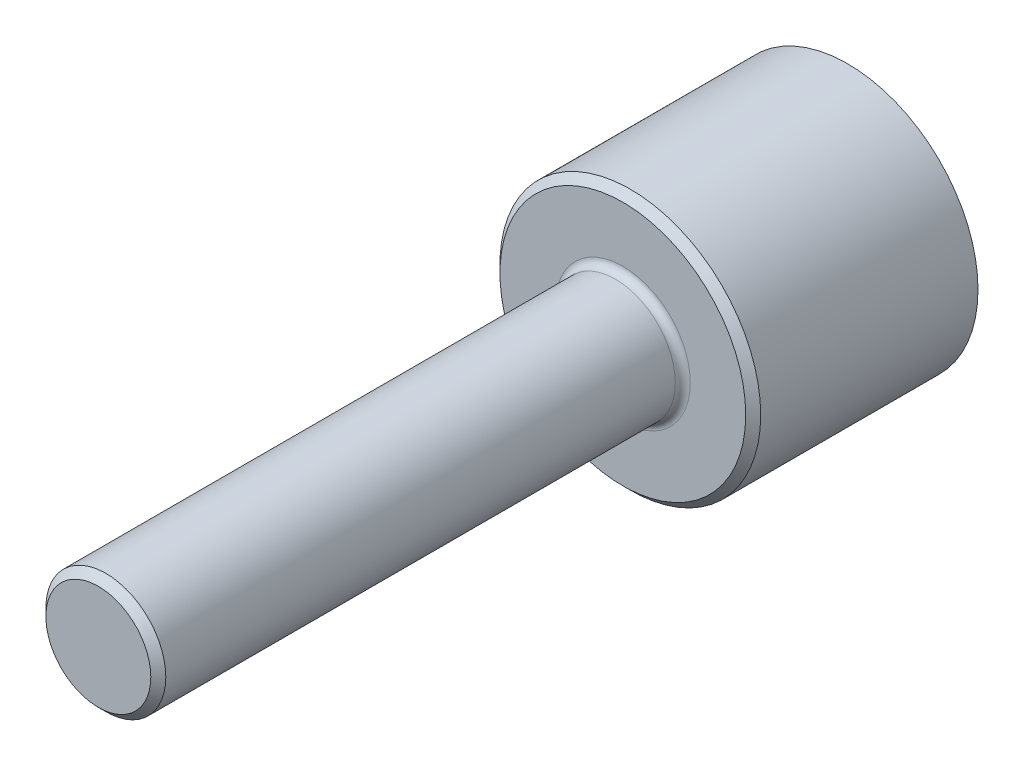
ISO-10303-21;
HEADER;
FILE_DESCRIPTION(('STEP AP214'),'2;1');
FILE_NAME('part.step','',(''),(''),'','','');
FILE_SCHEMA(('AUTOMOTIVE_DESIGN { 1 0 10303 214 1 1 1 1 }'));
ENDSEC;
DATA;
#1=APPLICATION_CONTEXT('core data for automotive mechanical design processes');
#2=APPLICATION_PROTOCOL_DEFINITION('international standard','automotive_design',2000,#1);
#3=PRODUCT_CONTEXT('',#1,'mechanical');
#4=PRODUCT('Part','Part','',(#3));
#5=PRODUCT_RELATED_PRODUCT_CATEGORY('part','',(#4));
#6=PRODUCT_DEFINITION_FORMATION('','',#4);
#7=PRODUCT_DEFINITION_CONTEXT('part definition',#1,'design');
#8=PRODUCT_DEFINITION('design','',#6,#7);
#9=PRODUCT_DEFINITION_SHAPE('','',#8);
#10=(LENGTH_UNIT() NAMED_UNIT(*) SI_UNIT(.MILLI.,.METRE.));
#11=(NAMED_UNIT(*) PLANE_ANGLE_UNIT() SI_UNIT($,.RADIAN.));
#12=(NAMED_UNIT(*) SI_UNIT($,.STERADIAN.) SOLID_ANGLE_UNIT());
#13=UNCERTAINTY_MEASURE_WITH_UNIT(LENGTH_MEASURE(1.E-05),#10,'distance_accuracy_value','');
#14=(GEOMETRIC_REPRESENTATION_CONTEXT(3) GLOBAL_UNCERTAINTY_ASSIGNED_CONTEXT((#13)) GLOBAL_UNIT_ASSIGNED_CONTEXT((#10,
#11,#12)) REPRESENTATION_CONTEXT('',''));
#15=CARTESIAN_POINT('',(0.,0.,0.));
#16=DIRECTION('',(0.,0.,1.));
#17=DIRECTION('',(1.,0.,0.));
#18=AXIS2_PLACEMENT_3D('',#15,#16,#17);
#19=CARTESIAN_POINT('',(0.,0.,30.));
#20=DIRECTION('',(0.,0.,-1.));
#21=DIRECTION('',(-1.,0.,0.));
#22=AXIS2_PLACEMENT_3D('',#19,#20,#21);
#23=CYLINDRICAL_SURFACE('',#22,17.4);
#24=CARTESIAN_POINT('',(0.,0.,29.));
#25=DIRECTION('',(0.,0.,1.));
#26=DIRECTION('',(1.,0.,0.));
#27=AXIS2_PLACEMENT_3D('',#24,#25,#26);
#28=CIRCLE('',#27,17.4);
#29=CARTESIAN_POINT('',(17.4,0.,29.));
#30=VERTEX_POINT('',#29);
#31=EDGE_CURVE('E57',#30,#30,#28,.F.);
#32=ORIENTED_EDGE('',*,*,#31,.T.);
#33=EDGE_LOOP('',(#32));
#34=FACE_BOUND('',#33,.T.);
#35=CARTESIAN_POINT('',(0.,0.,0.));
#36=DIRECTION('',(0.,0.,1.));
#37=DIRECTION('',(1.,0.,0.));
#38=AXIS2_PLACEMENT_3D('',#35,#36,#37);
#39=CIRCLE('',#38,17.4);
#40=CARTESIAN_POINT('',(17.4,0.,0.));
#41=VERTEX_POINT('',#40);
#42=EDGE_CURVE('E77',#41,#41,#39,.T.);
#43=ORIENTED_EDGE('',*,*,#42,.T.);
#44=EDGE_LOOP('',(#43));
#45=FACE_BOUND('',#44,.T.);
#46=ADVANCED_FACE('F43',(#34,#45),#23,.T.);
#47=CARTESIAN_POINT('',(0.,0.,30.));
#48=DIRECTION('',(0.,0.,1.));
#49=DIRECTION('',(1.,0.,0.));
#50=AXIS2_PLACEMENT_3D('',#47,#48,#49);
#51=PLANE('',#50);
#52=CARTESIAN_POINT('',(0.,0.,30.));
#53=DIRECTION('',(0.,0.,1.));
#54=DIRECTION('',(1.,0.,0.));
#55=AXIS2_PLACEMENT_3D('',#52,#53,#54);
#56=CIRCLE('',#55,9.);
#57=CARTESIAN_POINT('',(9.00000000000001,0.,30.));
#58=VERTEX_POINT('',#57);
#59=EDGE_CURVE('E10',#58,#58,#56,.F.);
#60=ORIENTED_EDGE('',*,*,#59,.T.);
#61=EDGE_LOOP('',(#60));
#62=FACE_BOUND('',#61,.T.);
#63=CARTESIAN_POINT('',(0.,0.,30.));
#64=DIRECTION('',(0.,0.,1.));
#65=DIRECTION('',(1.,0.,0.));
#66=AXIS2_PLACEMENT_3D('',#63,#64,#65);
#67=CIRCLE('',#66,16.4);
#68=CARTESIAN_POINT('',(16.4,0.,30.));
#69=VERTEX_POINT('',#68);
#70=EDGE_CURVE('E63',#69,#69,#67,.T.);
#71=ORIENTED_EDGE('',*,*,#70,.T.);
#72=EDGE_LOOP('',(#71));
#73=FACE_BOUND('',#72,.T.);
#74=ADVANCED_FACE('F87',(#62,#73),#51,.T.);
#75=CARTESIAN_POINT('',(0.,0.,0.));
#76=DIRECTION('',(0.,0.,1.));
#77=DIRECTION('',(1.,0.,0.));
#78=AXIS2_PLACEMENT_3D('',#75,#76,#77);
#79=PLANE('',#78);
#80=ORIENTED_EDGE('',*,*,#42,.F.);
#81=EDGE_LOOP('',(#80));
#82=FACE_BOUND('',#81,.T.);
#83=ADVANCED_FACE('F84',(#82),#79,.F.);
#84=CARTESIAN_POINT('',(0.,0.,99.9999999999999));
#85=DIRECTION('',(0.,0.,-1.));
#86=DIRECTION('',(-1.,0.,0.));
#87=AXIS2_PLACEMENT_3D('',#84,#85,#86);
#88=CYLINDRICAL_SURFACE('',#87,8.);
#89=CARTESIAN_POINT('',(0.,0.,31.));
#90=DIRECTION('',(0.,0.,1.));
#91=DIRECTION('',(1.,0.,0.));
#92=AXIS2_PLACEMENT_3D('',#89,#90,#91);
#93=CIRCLE('',#92,8.);
#94=CARTESIAN_POINT('',(8.,0.,31.));
#95=VERTEX_POINT('',#94);
#96=EDGE_CURVE('E51',#95,#95,#93,.T.);
#97=ORIENTED_EDGE('',*,*,#96,.T.);
#98=EDGE_LOOP('',(#97));
#99=FACE_BOUND('',#98,.T.);
#100=CARTESIAN_POINT('',(0.,0.,98.9999999999999));
#101=DIRECTION('',(0.,0.,1.));
#102=DIRECTION('',(1.,0.,0.));
#103=AXIS2_PLACEMENT_3D('',#100,#101,#102);
#104=CIRCLE('',#103,8.);
#105=CARTESIAN_POINT('',(8.,0.,98.9999999999999));
#106=VERTEX_POINT('',#105);
#107=EDGE_CURVE('E69',#106,#106,#104,.F.);
#108=ORIENTED_EDGE('',*,*,#107,.T.);
#109=EDGE_LOOP('',(#108));
#110=FACE_BOUND('',#109,.T.);
#111=ADVANCED_FACE('F86',(#99,#110),#88,.T.);
#112=CARTESIAN_POINT('',(0.,0.,99.9999999999999));
#113=DIRECTION('',(0.,0.,1.));
#114=DIRECTION('',(1.,0.,0.));
#115=AXIS2_PLACEMENT_3D('',#112,#113,#114);
#116=PLANE('',#115);
#117=CARTESIAN_POINT('',(0.,0.,99.9999999999999));
#118=DIRECTION('',(0.,0.,1.));
#119=DIRECTION('',(1.,0.,0.));
#120=AXIS2_PLACEMENT_3D('',#117,#118,#119);
#121=CIRCLE('',#120,7.00000000000001);
#122=CARTESIAN_POINT('',(7.00000000000001,0.,99.9999999999999));
#123=VERTEX_POINT('',#122);
#124=EDGE_CURVE('E73',#123,#123,#121,.T.);
#125=ORIENTED_EDGE('',*,*,#124,.T.);
#126=EDGE_LOOP('',(#125));
#127=FACE_BOUND('',#126,.T.);
#128=ADVANCED_FACE('F93',(#127),#116,.T.);
#129=CARTESIAN_POINT('',(0.,0.,99.9999999999999));
#130=DIRECTION('',(0.,0.,-1.));
#131=DIRECTION('',(-1.,0.,0.));
#132=AXIS2_PLACEMENT_3D('',#129,#130,#131);
#133=CONICAL_SURFACE('',#132,7.00000000000001,0.785398163397445);
#134=ORIENTED_EDGE('',*,*,#107,.F.);
#135=EDGE_LOOP('',(#134));
#136=FACE_BOUND('',#135,.T.);
#137=ORIENTED_EDGE('',*,*,#124,.F.);
#138=EDGE_LOOP('',(#137));
#139=FACE_BOUND('',#138,.T.);
#140=ADVANCED_FACE('F103',(#136,#139),#133,.T.);
#141=CARTESIAN_POINT('',(0.,0.,30.));
#142=DIRECTION('',(0.,0.,-1.));
#143=DIRECTION('',(-1.,0.,0.));
#144=AXIS2_PLACEMENT_3D('',#141,#142,#143);
#145=CONICAL_SURFACE('',#144,16.4,0.785398163397445);
#146=ORIENTED_EDGE('',*,*,#31,.F.);
#147=EDGE_LOOP('',(#146));
#148=FACE_BOUND('',#147,.T.);
#149=ORIENTED_EDGE('',*,*,#70,.F.);
#150=EDGE_LOOP('',(#149));
#151=FACE_BOUND('',#150,.T.);
#152=ADVANCED_FACE('F108',(#148,#151),#145,.T.);
#153=CARTESIAN_POINT('',(0.,0.,31.));
#154=DIRECTION('',(0.,0.,1.));
#155=DIRECTION('',(1.,0.,0.));
#156=AXIS2_PLACEMENT_3D('',#153,#154,#155);
#157=TOROIDAL_SURFACE('',#156,9.,1.);
#158=ORIENTED_EDGE('',*,*,#59,.F.);
#159=EDGE_LOOP('',(#158));
#160=FACE_BOUND('',#159,.T.);
#161=ORIENTED_EDGE('',*,*,#96,.F.);
#162=EDGE_LOOP('',(#161));
#163=FACE_BOUND('',#162,.T.);
#164=ADVANCED_FACE('F45',(#160,#163),#157,.F.);
#165=CLOSED_SHELL('',(#46,#74,#83,#111,#128,#140,#152,#164));
#166=MANIFOLD_SOLID_BREP('B2',#165);
#167=ADVANCED_BREP_SHAPE_REPRESENTATION('',(#18,#166),#14);
#168=SHAPE_DEFINITION_REPRESENTATION(#9,#167);
ENDSEC;
END-ISO-10303-21;
